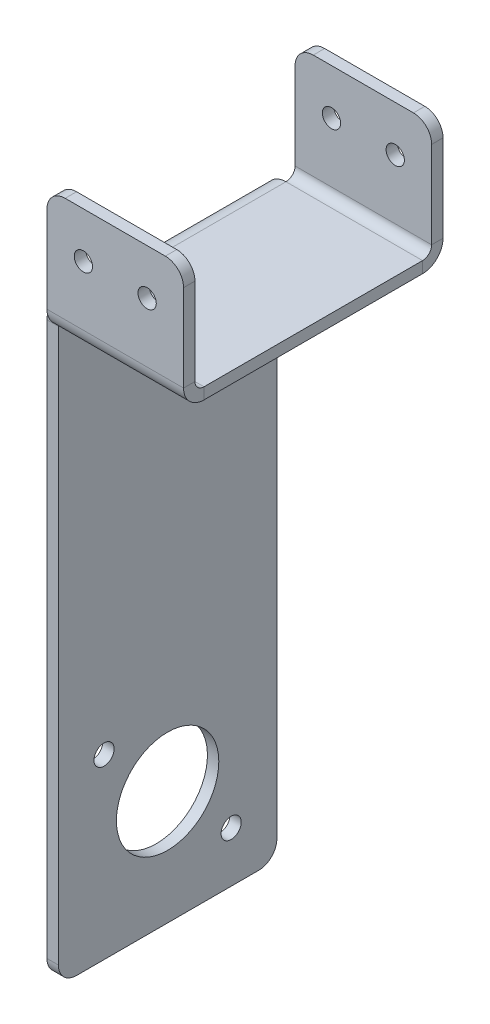
ISO-10303-21;
HEADER;
FILE_DESCRIPTION(('STEP AP214'),'2;1');
FILE_NAME('part.step','',(''),(''),'','','');
FILE_SCHEMA(('AUTOMOTIVE_DESIGN { 1 0 10303 214 1 1 1 1 }'));
ENDSEC;
DATA;
#1=APPLICATION_CONTEXT('core data for automotive mechanical design processes');
#2=APPLICATION_PROTOCOL_DEFINITION('international standard','automotive_design',2000,#1);
#3=PRODUCT_CONTEXT('',#1,'mechanical');
#4=PRODUCT('Part','Part','',(#3));
#5=PRODUCT_RELATED_PRODUCT_CATEGORY('part','',(#4));
#6=PRODUCT_DEFINITION_FORMATION('','',#4);
#7=PRODUCT_DEFINITION_CONTEXT('part definition',#1,'design');
#8=PRODUCT_DEFINITION('design','',#6,#7);
#9=PRODUCT_DEFINITION_SHAPE('','',#8);
#10=(LENGTH_UNIT() NAMED_UNIT(*) SI_UNIT(.MILLI.,.METRE.));
#11=(NAMED_UNIT(*) PLANE_ANGLE_UNIT() SI_UNIT($,.RADIAN.));
#12=(NAMED_UNIT(*) SI_UNIT($,.STERADIAN.) SOLID_ANGLE_UNIT());
#13=UNCERTAINTY_MEASURE_WITH_UNIT(LENGTH_MEASURE(1.E-05),#10,'distance_accuracy_value','');
#14=(GEOMETRIC_REPRESENTATION_CONTEXT(3) GLOBAL_UNCERTAINTY_ASSIGNED_CONTEXT((#13)) GLOBAL_UNIT_ASSIGNED_CONTEXT((#10,
#11,#12)) REPRESENTATION_CONTEXT('',''));
#15=CARTESIAN_POINT('',(0.,0.,0.));
#16=DIRECTION('',(0.,0.,1.));
#17=DIRECTION('',(1.,0.,0.));
#18=AXIS2_PLACEMENT_3D('',#15,#16,#17);
#19=CARTESIAN_POINT('',(19.05,-3.175,30.48));
#20=DIRECTION('',(1.,0.,0.));
#21=DIRECTION('',(0.,0.,-1.));
#22=AXIS2_PLACEMENT_3D('',#19,#20,#21);
#23=PLANE('',#22);
#24=DIRECTION('',(0.,0.,-1.));
#25=VECTOR('',#24,1.);
#26=CARTESIAN_POINT('',(19.05,0.,30.48));
#27=LINE('',#26,#25);
#28=CARTESIAN_POINT('',(19.05,0.,30.48));
#29=VERTEX_POINT('',#28);
#30=CARTESIAN_POINT('',(19.05,0.,-30.48));
#31=VERTEX_POINT('',#30);
#32=EDGE_CURVE('E370',#29,#31,#27,.T.);
#33=ORIENTED_EDGE('',*,*,#32,.F.);
#34=DIRECTION('',(0.,1.,0.));
#35=VECTOR('',#34,1.);
#36=CARTESIAN_POINT('',(19.05,-3.175,30.48));
#37=LINE('',#36,#35);
#38=CARTESIAN_POINT('',(19.05,-3.175,30.48));
#39=VERTEX_POINT('',#38);
#40=EDGE_CURVE('E399',#39,#29,#37,.T.);
#41=ORIENTED_EDGE('',*,*,#40,.F.);
#42=DIRECTION('',(0.,0.,-1.));
#43=VECTOR('',#42,1.);
#44=CARTESIAN_POINT('',(19.05,-3.175,30.48));
#45=LINE('',#44,#43);
#46=CARTESIAN_POINT('',(19.05,-3.175,-30.48));
#47=VERTEX_POINT('',#46);
#48=EDGE_CURVE('E379',#39,#47,#45,.T.);
#49=ORIENTED_EDGE('',*,*,#48,.T.);
#50=DIRECTION('',(0.,1.,0.));
#51=VECTOR('',#50,1.);
#52=CARTESIAN_POINT('',(19.05,-3.175,-30.48));
#53=LINE('',#52,#51);
#54=EDGE_CURVE('E391',#47,#31,#53,.T.);
#55=ORIENTED_EDGE('',*,*,#54,.T.);
#56=EDGE_LOOP('',(#33,#41,#49,#55));
#57=FACE_BOUND('',#56,.T.);
#58=ADVANCED_FACE('F99',(#57),#23,.T.);
#59=CARTESIAN_POINT('',(0.,-3.175,0.));
#60=DIRECTION('',(0.,-1.,0.));
#61=DIRECTION('',(0.,0.,-1.));
#62=AXIS2_PLACEMENT_3D('',#59,#60,#61);
#63=PLANE('',#62);
#64=ORIENTED_EDGE('',*,*,#48,.F.);
#65=DIRECTION('',(1.,0.,0.));
#66=VECTOR('',#65,1.);
#67=CARTESIAN_POINT('',(-19.05,-3.175,30.48));
#68=LINE('',#67,#66);
#69=CARTESIAN_POINT('',(-19.05,-3.175,30.48));
#70=VERTEX_POINT('',#69);
#71=EDGE_CURVE('E388',#70,#39,#68,.T.);
#72=ORIENTED_EDGE('',*,*,#71,.F.);
#73=DIRECTION('',(0.,0.,1.));
#74=VECTOR('',#73,1.);
#75=CARTESIAN_POINT('',(-19.05,-3.175,30.48));
#76=LINE('',#75,#74);
#77=CARTESIAN_POINT('',(-19.05,-3.17500000000003,-30.48));
#78=VERTEX_POINT('',#77);
#79=EDGE_CURVE('E386',#78,#70,#76,.T.);
#80=ORIENTED_EDGE('',*,*,#79,.F.);
#81=DIRECTION('',(-1.,0.,0.));
#82=VECTOR('',#81,1.);
#83=CARTESIAN_POINT('',(-19.05,-3.175,-30.48));
#84=LINE('',#83,#82);
#85=EDGE_CURVE('E382',#47,#78,#84,.T.);
#86=ORIENTED_EDGE('',*,*,#85,.F.);
#87=EDGE_LOOP('',(#64,#72,#80,#86));
#88=FACE_BOUND('',#87,.T.);
#89=ADVANCED_FACE('F499',(#88),#63,.T.);
#90=CARTESIAN_POINT('',(0.,0.,0.));
#91=DIRECTION('',(0.,-1.,0.));
#92=DIRECTION('',(0.,0.,-1.));
#93=AXIS2_PLACEMENT_3D('',#90,#91,#92);
#94=PLANE('',#93);
#95=ORIENTED_EDGE('',*,*,#32,.T.);
#96=DIRECTION('',(-1.,0.,0.));
#97=VECTOR('',#96,1.);
#98=CARTESIAN_POINT('',(-19.05,0.,-30.48));
#99=LINE('',#98,#97);
#100=CARTESIAN_POINT('',(-19.05,0.,-30.48));
#101=VERTEX_POINT('',#100);
#102=EDGE_CURVE('E394',#31,#101,#99,.T.);
#103=ORIENTED_EDGE('',*,*,#102,.T.);
#104=DIRECTION('',(0.,0.,1.));
#105=VECTOR('',#104,1.);
#106=CARTESIAN_POINT('',(-19.05,0.,30.48));
#107=LINE('',#106,#105);
#108=CARTESIAN_POINT('',(-19.05,0.,30.48));
#109=VERTEX_POINT('',#108);
#110=EDGE_CURVE('E258',#101,#109,#107,.T.);
#111=ORIENTED_EDGE('',*,*,#110,.T.);
#112=DIRECTION('',(1.,0.,0.));
#113=VECTOR('',#112,1.);
#114=CARTESIAN_POINT('',(-19.05,0.,30.48));
#115=LINE('',#114,#113);
#116=EDGE_CURVE('E383',#109,#29,#115,.T.);
#117=ORIENTED_EDGE('',*,*,#116,.T.);
#118=EDGE_LOOP('',(#95,#103,#111,#117));
#119=FACE_BOUND('',#118,.T.);
#120=ADVANCED_FACE('F560',(#119),#94,.F.);
#121=CARTESIAN_POINT('',(-19.05,2.53999999999999,30.48));
#122=DIRECTION('',(-1.,0.,0.));
#123=DIRECTION('',(0.,0.,1.));
#124=AXIS2_PLACEMENT_3D('',#121,#122,#123);
#125=PLANE('',#124);
#126=DIRECTION('',(0.,0.,-1.));
#127=VECTOR('',#126,1.);
#128=CARTESIAN_POINT('',(-19.05,2.53999999999999,36.195));
#129=LINE('',#128,#127);
#130=CARTESIAN_POINT('',(-19.05,2.53999999999999,33.02));
#131=VERTEX_POINT('',#130);
#132=CARTESIAN_POINT('',(-19.05,2.53999999999999,36.195));
#133=VERTEX_POINT('',#132);
#134=EDGE_CURVE('E331',#131,#133,#129,.F.);
#135=ORIENTED_EDGE('',*,*,#134,.F.);
#136=CARTESIAN_POINT('',(-19.05,2.53999999999999,30.48));
#137=DIRECTION('',(1.,0.,0.));
#138=DIRECTION('',(0.,0.,-1.));
#139=AXIS2_PLACEMENT_3D('',#136,#137,#138);
#140=CIRCLE('',#139,2.53999999999999);
#141=EDGE_CURVE('E374',#109,#131,#140,.F.);
#142=ORIENTED_EDGE('',*,*,#141,.F.);
#143=DIRECTION('',(0.,1.,0.));
#144=VECTOR('',#143,1.);
#145=CARTESIAN_POINT('',(-19.05,-3.175,30.48));
#146=LINE('',#145,#144);
#147=EDGE_CURVE('E403',#70,#109,#146,.T.);
#148=ORIENTED_EDGE('',*,*,#147,.F.);
#149=CARTESIAN_POINT('',(-19.05,2.53999999999999,30.48));
#150=DIRECTION('',(1.,0.,0.));
#151=DIRECTION('',(0.,0.,-1.));
#152=AXIS2_PLACEMENT_3D('',#149,#150,#151);
#153=CIRCLE('',#152,5.71499999999999);
#154=EDGE_CURVE('E367',#70,#133,#153,.F.);
#155=ORIENTED_EDGE('',*,*,#154,.T.);
#156=EDGE_LOOP('',(#135,#142,#148,#155));
#157=FACE_BOUND('',#156,.T.);
#158=ADVANCED_FACE('F506',(#157),#125,.T.);
#159=CARTESIAN_POINT('',(19.05,2.53999999999999,30.48));
#160=DIRECTION('',(-1.,0.,0.));
#161=DIRECTION('',(0.,0.,1.));
#162=AXIS2_PLACEMENT_3D('',#159,#160,#161);
#163=PLANE('',#162);
#164=CARTESIAN_POINT('',(19.05,2.53999999999999,30.48));
#165=DIRECTION('',(1.,0.,0.));
#166=DIRECTION('',(0.,0.,-1.));
#167=AXIS2_PLACEMENT_3D('',#164,#165,#166);
#168=CIRCLE('',#167,2.53999999999999);
#169=CARTESIAN_POINT('',(19.05,2.53999999999999,33.02));
#170=VERTEX_POINT('',#169);
#171=EDGE_CURVE('E343',#170,#29,#168,.T.);
#172=ORIENTED_EDGE('',*,*,#171,.F.);
#173=DIRECTION('',(0.,0.,-1.));
#174=VECTOR('',#173,1.);
#175=CARTESIAN_POINT('',(19.05,2.53999999999999,33.02));
#176=LINE('',#175,#174);
#177=CARTESIAN_POINT('',(19.05,2.53999999999999,36.195));
#178=VERTEX_POINT('',#177);
#179=EDGE_CURVE('E360',#170,#178,#176,.F.);
#180=ORIENTED_EDGE('',*,*,#179,.T.);
#181=CARTESIAN_POINT('',(19.05,2.53999999999999,30.48));
#182=DIRECTION('',(1.,0.,0.));
#183=DIRECTION('',(0.,0.,-1.));
#184=AXIS2_PLACEMENT_3D('',#181,#182,#183);
#185=CIRCLE('',#184,5.71499999999999);
#186=EDGE_CURVE('E371',#178,#39,#185,.T.);
#187=ORIENTED_EDGE('',*,*,#186,.T.);
#188=ORIENTED_EDGE('',*,*,#40,.T.);
#189=EDGE_LOOP('',(#172,#180,#187,#188));
#190=FACE_BOUND('',#189,.T.);
#191=ADVANCED_FACE('F912',(#190),#163,.F.);
#192=CARTESIAN_POINT('',(19.05,2.53999999999999,30.48));
#193=DIRECTION('',(1.,0.,0.));
#194=DIRECTION('',(0.,0.,1.));
#195=AXIS2_PLACEMENT_3D('',#192,#193,#194);
#196=CYLINDRICAL_SURFACE('',#195,5.71499999999999);
#197=ORIENTED_EDGE('',*,*,#71,.T.);
#198=ORIENTED_EDGE('',*,*,#186,.F.);
#199=DIRECTION('',(1.,0.,0.));
#200=VECTOR('',#199,1.);
#201=CARTESIAN_POINT('',(-19.05,2.53999999999999,36.195));
#202=LINE('',#201,#200);
#203=EDGE_CURVE('E357',#178,#133,#202,.F.);
#204=ORIENTED_EDGE('',*,*,#203,.T.);
#205=ORIENTED_EDGE('',*,*,#154,.F.);
#206=EDGE_LOOP('',(#197,#198,#204,#205));
#207=FACE_BOUND('',#206,.T.);
#208=ADVANCED_FACE('F507',(#207),#196,.T.);
#209=CARTESIAN_POINT('',(19.05,2.53999999999999,30.48));
#210=DIRECTION('',(1.,0.,0.));
#211=DIRECTION('',(0.,0.,1.));
#212=AXIS2_PLACEMENT_3D('',#209,#210,#211);
#213=CYLINDRICAL_SURFACE('',#212,2.53999999999999);
#214=ORIENTED_EDGE('',*,*,#116,.F.);
#215=ORIENTED_EDGE('',*,*,#141,.T.);
#216=DIRECTION('',(1.,0.,0.));
#217=VECTOR('',#216,1.);
#218=CARTESIAN_POINT('',(-19.05,2.53999999999999,33.02));
#219=LINE('',#218,#217);
#220=EDGE_CURVE('E363',#131,#170,#219,.T.);
#221=ORIENTED_EDGE('',*,*,#220,.T.);
#222=ORIENTED_EDGE('',*,*,#171,.T.);
#223=EDGE_LOOP('',(#214,#215,#221,#222));
#224=FACE_BOUND('',#223,.T.);
#225=ADVANCED_FACE('F537',(#224),#213,.F.);
#226=CARTESIAN_POINT('',(-19.05,0.,36.195));
#227=DIRECTION('',(1.,0.,0.));
#228=DIRECTION('',(0.,1.,0.));
#229=AXIS2_PLACEMENT_3D('',#226,#227,#228);
#230=PLANE('',#229);
#231=DIRECTION('',(0.,-1.,0.));
#232=VECTOR('',#231,1.);
#233=CARTESIAN_POINT('',(-19.05,0.,36.195));
#234=LINE('',#233,#232);
#235=CARTESIAN_POINT('',(-19.05,26.797,36.195));
#236=VERTEX_POINT('',#235);
#237=EDGE_CURVE('E347',#236,#133,#234,.T.);
#238=ORIENTED_EDGE('',*,*,#237,.F.);
#239=DIRECTION('',(0.,0.,-1.));
#240=VECTOR('',#239,1.);
#241=CARTESIAN_POINT('',(-19.05,26.797,36.195));
#242=LINE('',#241,#240);
#243=CARTESIAN_POINT('',(-19.05,26.797,33.02));
#244=VERTEX_POINT('',#243);
#245=EDGE_CURVE('E442',#236,#244,#242,.T.);
#246=ORIENTED_EDGE('',*,*,#245,.T.);
#247=DIRECTION('',(0.,1.,0.));
#248=VECTOR('',#247,1.);
#249=CARTESIAN_POINT('',(-19.05,0.,33.02));
#250=LINE('',#249,#248);
#251=EDGE_CURVE('E355',#244,#131,#250,.F.);
#252=ORIENTED_EDGE('',*,*,#251,.T.);
#253=ORIENTED_EDGE('',*,*,#134,.T.);
#254=EDGE_LOOP('',(#238,#246,#252,#253));
#255=FACE_BOUND('',#254,.T.);
#256=ADVANCED_FACE('F532',(#255),#230,.F.);
#257=CARTESIAN_POINT('',(19.05,31.877,36.195));
#258=DIRECTION('',(-1.,0.,0.));
#259=DIRECTION('',(0.,-1.,0.));
#260=AXIS2_PLACEMENT_3D('',#257,#258,#259);
#261=PLANE('',#260);
#262=DIRECTION('',(0.,-1.,0.));
#263=VECTOR('',#262,1.);
#264=CARTESIAN_POINT('',(19.05,31.877,33.02));
#265=LINE('',#264,#263);
#266=CARTESIAN_POINT('',(19.05,26.797,33.02));
#267=VERTEX_POINT('',#266);
#268=EDGE_CURVE('E352',#170,#267,#265,.F.);
#269=ORIENTED_EDGE('',*,*,#268,.T.);
#270=DIRECTION('',(0.,0.,-1.));
#271=VECTOR('',#270,1.);
#272=CARTESIAN_POINT('',(19.05,26.797,36.195));
#273=LINE('',#272,#271);
#274=CARTESIAN_POINT('',(19.05,26.797,36.195));
#275=VERTEX_POINT('',#274);
#276=EDGE_CURVE('E436',#267,#275,#273,.F.);
#277=ORIENTED_EDGE('',*,*,#276,.T.);
#278=DIRECTION('',(0.,1.,0.));
#279=VECTOR('',#278,1.);
#280=CARTESIAN_POINT('',(19.05,0.,36.195));
#281=LINE('',#280,#279);
#282=EDGE_CURVE('E344',#178,#275,#281,.T.);
#283=ORIENTED_EDGE('',*,*,#282,.F.);
#284=ORIENTED_EDGE('',*,*,#179,.F.);
#285=EDGE_LOOP('',(#269,#277,#283,#284));
#286=FACE_BOUND('',#285,.T.);
#287=ADVANCED_FACE('F516',(#286),#261,.F.);
#288=CARTESIAN_POINT('',(0.,0.,36.195));
#289=DIRECTION('',(0.,0.,-1.));
#290=DIRECTION('',(-1.,0.,0.));
#291=AXIS2_PLACEMENT_3D('',#288,#289,#290);
#292=PLANE('',#291);
#293=CARTESIAN_POINT('',(8.89,19.177,36.195));
#294=DIRECTION('',(0.,0.,1.));
#295=DIRECTION('',(1.,0.,0.));
#296=AXIS2_PLACEMENT_3D('',#293,#294,#295);
#297=CIRCLE('',#296,2.5527);
#298=CARTESIAN_POINT('',(11.4427,19.177,36.195));
#299=VERTEX_POINT('',#298);
#300=EDGE_CURVE('E1048',#299,#299,#297,.T.);
#301=ORIENTED_EDGE('',*,*,#300,.F.);
#302=EDGE_LOOP('',(#301));
#303=FACE_BOUND('',#302,.T.);
#304=CARTESIAN_POINT('',(-8.88999999999999,19.177,36.195));
#305=DIRECTION('',(0.,0.,1.));
#306=DIRECTION('',(1.,0.,0.));
#307=AXIS2_PLACEMENT_3D('',#304,#305,#306);
#308=CIRCLE('',#307,2.5527);
#309=CARTESIAN_POINT('',(-6.33729999999999,19.177,36.195));
#310=VERTEX_POINT('',#309);
#311=EDGE_CURVE('E1042',#310,#310,#308,.T.);
#312=ORIENTED_EDGE('',*,*,#311,.F.);
#313=EDGE_LOOP('',(#312));
#314=FACE_BOUND('',#313,.T.);
#315=ORIENTED_EDGE('',*,*,#282,.T.);
#316=CARTESIAN_POINT('',(13.97,26.797,36.195));
#317=DIRECTION('',(0.,0.,-1.));
#318=DIRECTION('',(-1.,0.,0.));
#319=AXIS2_PLACEMENT_3D('',#316,#317,#318);
#320=CIRCLE('',#319,5.08);
#321=CARTESIAN_POINT('',(13.97,31.877,36.195));
#322=VERTEX_POINT('',#321);
#323=EDGE_CURVE('E440',#275,#322,#320,.F.);
#324=ORIENTED_EDGE('',*,*,#323,.T.);
#325=DIRECTION('',(-1.,0.,0.));
#326=VECTOR('',#325,1.);
#327=CARTESIAN_POINT('',(0.,31.877,36.195));
#328=LINE('',#327,#326);
#329=CARTESIAN_POINT('',(-13.97,31.877,36.195));
#330=VERTEX_POINT('',#329);
#331=EDGE_CURVE('E340',#322,#330,#328,.T.);
#332=ORIENTED_EDGE('',*,*,#331,.T.);
#333=CARTESIAN_POINT('',(-13.97,26.797,36.195));
#334=DIRECTION('',(0.,0.,-1.));
#335=DIRECTION('',(-1.,0.,0.));
#336=AXIS2_PLACEMENT_3D('',#333,#334,#335);
#337=CIRCLE('',#336,5.08);
#338=EDGE_CURVE('E438',#330,#236,#337,.F.);
#339=ORIENTED_EDGE('',*,*,#338,.T.);
#340=ORIENTED_EDGE('',*,*,#237,.T.);
#341=ORIENTED_EDGE('',*,*,#203,.F.);
#342=EDGE_LOOP('',(#315,#324,#332,#339,#340,#341));
#343=FACE_BOUND('',#342,.T.);
#344=ADVANCED_FACE('F511',(#303,#314,#343),#292,.F.);
#345=CARTESIAN_POINT('',(0.,0.,33.02));
#346=DIRECTION('',(0.,0.,-1.));
#347=DIRECTION('',(-1.,0.,0.));
#348=AXIS2_PLACEMENT_3D('',#345,#346,#347);
#349=PLANE('',#348);
#350=CARTESIAN_POINT('',(8.89,19.177,33.02));
#351=DIRECTION('',(0.,0.,-1.));
#352=DIRECTION('',(-1.,0.,0.));
#353=AXIS2_PLACEMENT_3D('',#350,#351,#352);
#354=CIRCLE('',#353,2.5527);
#355=CARTESIAN_POINT('',(6.33729999999999,19.177,33.02));
#356=VERTEX_POINT('',#355);
#357=EDGE_CURVE('E427',#356,#356,#354,.T.);
#358=ORIENTED_EDGE('',*,*,#357,.F.);
#359=EDGE_LOOP('',(#358));
#360=FACE_BOUND('',#359,.T.);
#361=CARTESIAN_POINT('',(-8.88999999999999,19.177,33.02));
#362=DIRECTION('',(0.,0.,-1.));
#363=DIRECTION('',(-1.,0.,0.));
#364=AXIS2_PLACEMENT_3D('',#361,#362,#363);
#365=CIRCLE('',#364,2.5527);
#366=CARTESIAN_POINT('',(-11.4427,19.177,33.02));
#367=VERTEX_POINT('',#366);
#368=EDGE_CURVE('E422',#367,#367,#365,.T.);
#369=ORIENTED_EDGE('',*,*,#368,.F.);
#370=EDGE_LOOP('',(#369));
#371=FACE_BOUND('',#370,.T.);
#372=DIRECTION('',(1.,0.,0.));
#373=VECTOR('',#372,1.);
#374=CARTESIAN_POINT('',(-19.05,31.877,33.02));
#375=LINE('',#374,#373);
#376=CARTESIAN_POINT('',(13.97,31.877,33.02));
#377=VERTEX_POINT('',#376);
#378=CARTESIAN_POINT('',(-13.97,31.877,33.02));
#379=VERTEX_POINT('',#378);
#380=EDGE_CURVE('E349',#377,#379,#375,.F.);
#381=ORIENTED_EDGE('',*,*,#380,.F.);
#382=CARTESIAN_POINT('',(13.97,26.797,33.02));
#383=DIRECTION('',(0.,0.,-1.));
#384=DIRECTION('',(-1.,0.,0.));
#385=AXIS2_PLACEMENT_3D('',#382,#383,#384);
#386=CIRCLE('',#385,5.08);
#387=EDGE_CURVE('E434',#377,#267,#386,.T.);
#388=ORIENTED_EDGE('',*,*,#387,.T.);
#389=ORIENTED_EDGE('',*,*,#268,.F.);
#390=ORIENTED_EDGE('',*,*,#220,.F.);
#391=ORIENTED_EDGE('',*,*,#251,.F.);
#392=CARTESIAN_POINT('',(-13.97,26.797,33.02));
#393=DIRECTION('',(0.,0.,-1.));
#394=DIRECTION('',(-1.,0.,0.));
#395=AXIS2_PLACEMENT_3D('',#392,#393,#394);
#396=CIRCLE('',#395,5.08);
#397=EDGE_CURVE('E432',#244,#379,#396,.T.);
#398=ORIENTED_EDGE('',*,*,#397,.T.);
#399=EDGE_LOOP('',(#381,#388,#389,#390,#391,#398));
#400=FACE_BOUND('',#399,.T.);
#401=ADVANCED_FACE('F540',(#360,#371,#400),#349,.T.);
#402=CARTESIAN_POINT('',(-19.05,31.877,36.195));
#403=DIRECTION('',(0.,-1.,0.));
#404=DIRECTION('',(0.,0.,-1.));
#405=AXIS2_PLACEMENT_3D('',#402,#403,#404);
#406=PLANE('',#405);
#407=ORIENTED_EDGE('',*,*,#331,.F.);
#408=DIRECTION('',(0.,0.,-1.));
#409=VECTOR('',#408,1.);
#410=CARTESIAN_POINT('',(13.97,31.877,36.195));
#411=LINE('',#410,#409);
#412=EDGE_CURVE('E429',#322,#377,#411,.T.);
#413=ORIENTED_EDGE('',*,*,#412,.T.);
#414=ORIENTED_EDGE('',*,*,#380,.T.);
#415=DIRECTION('',(0.,0.,-1.));
#416=VECTOR('',#415,1.);
#417=CARTESIAN_POINT('',(-13.97,31.877,36.195));
#418=LINE('',#417,#416);
#419=EDGE_CURVE('E402',#379,#330,#418,.F.);
#420=ORIENTED_EDGE('',*,*,#419,.T.);
#421=EDGE_LOOP('',(#407,#413,#414,#420));
#422=FACE_BOUND('',#421,.T.);
#423=ADVANCED_FACE('F525',(#422),#406,.F.);
#424=CARTESIAN_POINT('',(19.05,2.53999999999997,-30.48));
#425=DIRECTION('',(1.,0.,0.));
#426=DIRECTION('',(0.,0.,-1.));
#427=AXIS2_PLACEMENT_3D('',#424,#425,#426);
#428=PLANE('',#427);
#429=DIRECTION('',(0.,0.,1.));
#430=VECTOR('',#429,1.);
#431=CARTESIAN_POINT('',(19.05,2.54000000000001,-36.195));
#432=LINE('',#431,#430);
#433=CARTESIAN_POINT('',(19.05,2.53999999999996,-33.02));
#434=VERTEX_POINT('',#433);
#435=CARTESIAN_POINT('',(19.05,2.53999999999995,-36.195));
#436=VERTEX_POINT('',#435);
#437=EDGE_CURVE('E296',#434,#436,#432,.F.);
#438=ORIENTED_EDGE('',*,*,#437,.F.);
#439=CARTESIAN_POINT('',(19.05,2.53999999999997,-30.48));
#440=DIRECTION('',(-1.,0.,0.));
#441=DIRECTION('',(0.,0.,1.));
#442=AXIS2_PLACEMENT_3D('',#439,#440,#441);
#443=CIRCLE('',#442,2.54);
#444=EDGE_CURVE('E335',#31,#434,#443,.F.);
#445=ORIENTED_EDGE('',*,*,#444,.F.);
#446=ORIENTED_EDGE('',*,*,#54,.F.);
#447=CARTESIAN_POINT('',(19.05,2.53999999999997,-30.48));
#448=DIRECTION('',(-1.,0.,0.));
#449=DIRECTION('',(0.,0.,1.));
#450=AXIS2_PLACEMENT_3D('',#447,#448,#449);
#451=CIRCLE('',#450,5.715);
#452=EDGE_CURVE('E328',#47,#436,#451,.F.);
#453=ORIENTED_EDGE('',*,*,#452,.T.);
#454=EDGE_LOOP('',(#438,#445,#446,#453));
#455=FACE_BOUND('',#454,.T.);
#456=ADVANCED_FACE('F548',(#455),#428,.T.);
#457=CARTESIAN_POINT('',(-19.05,2.53999999999997,-30.48));
#458=DIRECTION('',(1.,0.,0.));
#459=DIRECTION('',(0.,0.,-1.));
#460=AXIS2_PLACEMENT_3D('',#457,#458,#459);
#461=PLANE('',#460);
#462=CARTESIAN_POINT('',(-19.05,2.53999999999997,-30.48));
#463=DIRECTION('',(-1.,0.,0.));
#464=DIRECTION('',(0.,0.,1.));
#465=AXIS2_PLACEMENT_3D('',#462,#463,#464);
#466=CIRCLE('',#465,2.54);
#467=CARTESIAN_POINT('',(-19.05,2.53999999999996,-33.02));
#468=VERTEX_POINT('',#467);
#469=EDGE_CURVE('E304',#468,#101,#466,.T.);
#470=ORIENTED_EDGE('',*,*,#469,.F.);
#471=DIRECTION('',(0.,0.,1.));
#472=VECTOR('',#471,1.);
#473=CARTESIAN_POINT('',(-19.05,2.53999999999999,-33.02));
#474=LINE('',#473,#472);
#475=CARTESIAN_POINT('',(-19.05,2.54000000000001,-36.195));
#476=VERTEX_POINT('',#475);
#477=EDGE_CURVE('E321',#468,#476,#474,.F.);
#478=ORIENTED_EDGE('',*,*,#477,.T.);
#479=CARTESIAN_POINT('',(-19.05,2.53999999999997,-30.48));
#480=DIRECTION('',(-1.,0.,0.));
#481=DIRECTION('',(0.,0.,1.));
#482=AXIS2_PLACEMENT_3D('',#479,#480,#481);
#483=CIRCLE('',#482,5.715);
#484=EDGE_CURVE('E332',#476,#78,#483,.T.);
#485=ORIENTED_EDGE('',*,*,#484,.T.);
#486=DIRECTION('',(0.,1.,0.));
#487=VECTOR('',#486,1.);
#488=CARTESIAN_POINT('',(-19.05,-3.175,-30.48));
#489=LINE('',#488,#487);
#490=EDGE_CURVE('E406',#78,#101,#489,.T.);
#491=ORIENTED_EDGE('',*,*,#490,.T.);
#492=EDGE_LOOP('',(#470,#478,#485,#491));
#493=FACE_BOUND('',#492,.T.);
#494=ADVANCED_FACE('F884',(#493),#461,.F.);
#495=CARTESIAN_POINT('',(-19.05,2.53999999999997,-30.48));
#496=DIRECTION('',(-1.,0.,0.));
#497=DIRECTION('',(0.,0.,-1.));
#498=AXIS2_PLACEMENT_3D('',#495,#496,#497);
#499=CYLINDRICAL_SURFACE('',#498,5.715);
#500=ORIENTED_EDGE('',*,*,#85,.T.);
#501=ORIENTED_EDGE('',*,*,#484,.F.);
#502=DIRECTION('',(-1.,0.,0.));
#503=VECTOR('',#502,1.);
#504=CARTESIAN_POINT('',(19.05,2.54000000000001,-36.195));
#505=LINE('',#504,#503);
#506=EDGE_CURVE('E318',#476,#436,#505,.F.);
#507=ORIENTED_EDGE('',*,*,#506,.T.);
#508=ORIENTED_EDGE('',*,*,#452,.F.);
#509=EDGE_LOOP('',(#500,#501,#507,#508));
#510=FACE_BOUND('',#509,.T.);
#511=ADVANCED_FACE('F873',(#510),#499,.T.);
#512=CARTESIAN_POINT('',(-19.05,2.53999999999997,-30.48));
#513=DIRECTION('',(-1.,0.,0.));
#514=DIRECTION('',(0.,0.,-1.));
#515=AXIS2_PLACEMENT_3D('',#512,#513,#514);
#516=CYLINDRICAL_SURFACE('',#515,2.54);
#517=ORIENTED_EDGE('',*,*,#102,.F.);
#518=ORIENTED_EDGE('',*,*,#444,.T.);
#519=DIRECTION('',(-1.,0.,0.));
#520=VECTOR('',#519,1.);
#521=CARTESIAN_POINT('',(19.05,2.53999999999999,-33.02));
#522=LINE('',#521,#520);
#523=EDGE_CURVE('E324',#434,#468,#522,.T.);
#524=ORIENTED_EDGE('',*,*,#523,.T.);
#525=ORIENTED_EDGE('',*,*,#469,.T.);
#526=EDGE_LOOP('',(#517,#518,#524,#525));
#527=FACE_BOUND('',#526,.T.);
#528=ADVANCED_FACE('F720',(#527),#516,.F.);
#529=CARTESIAN_POINT('',(19.05,0.,-36.195));
#530=DIRECTION('',(-1.,0.,0.));
#531=DIRECTION('',(0.,-1.,0.));
#532=AXIS2_PLACEMENT_3D('',#529,#530,#531);
#533=PLANE('',#532);
#534=DIRECTION('',(0.,-1.,0.));
#535=VECTOR('',#534,1.);
#536=CARTESIAN_POINT('',(19.05,-1.25535735171847E-13,-36.195));
#537=LINE('',#536,#535);
#538=CARTESIAN_POINT('',(19.05,26.797,-36.1950000000001));
#539=VERTEX_POINT('',#538);
#540=EDGE_CURVE('E308',#539,#436,#537,.T.);
#541=ORIENTED_EDGE('',*,*,#540,.F.);
#542=DIRECTION('',(0.,0.,1.));
#543=VECTOR('',#542,1.);
#544=CARTESIAN_POINT('',(19.05,26.797,-36.1950000000001));
#545=LINE('',#544,#543);
#546=CARTESIAN_POINT('',(19.05,26.797,-33.0200000000001));
#547=VERTEX_POINT('',#546);
#548=EDGE_CURVE('E460',#539,#547,#545,.T.);
#549=ORIENTED_EDGE('',*,*,#548,.T.);
#550=DIRECTION('',(0.,1.,0.));
#551=VECTOR('',#550,1.);
#552=CARTESIAN_POINT('',(19.05,0.,-33.02));
#553=LINE('',#552,#551);
#554=EDGE_CURVE('E316',#547,#434,#553,.F.);
#555=ORIENTED_EDGE('',*,*,#554,.T.);
#556=ORIENTED_EDGE('',*,*,#437,.T.);
#557=EDGE_LOOP('',(#541,#549,#555,#556));
#558=FACE_BOUND('',#557,.T.);
#559=ADVANCED_FACE('F709',(#558),#533,.F.);
#560=CARTESIAN_POINT('',(-19.05,31.877,-36.1950000000001));
#561=DIRECTION('',(1.,0.,0.));
#562=DIRECTION('',(0.,1.,0.));
#563=AXIS2_PLACEMENT_3D('',#560,#561,#562);
#564=PLANE('',#563);
#565=DIRECTION('',(0.,-1.,0.));
#566=VECTOR('',#565,1.);
#567=CARTESIAN_POINT('',(-19.05,31.877,-33.0200000000001));
#568=LINE('',#567,#566);
#569=CARTESIAN_POINT('',(-19.05,26.797,-33.0200000000001));
#570=VERTEX_POINT('',#569);
#571=EDGE_CURVE('E313',#468,#570,#568,.F.);
#572=ORIENTED_EDGE('',*,*,#571,.T.);
#573=DIRECTION('',(0.,0.,1.));
#574=VECTOR('',#573,1.);
#575=CARTESIAN_POINT('',(-19.05,26.797,-36.1950000000001));
#576=LINE('',#575,#574);
#577=CARTESIAN_POINT('',(-19.05,26.797,-36.1950000000001));
#578=VERTEX_POINT('',#577);
#579=EDGE_CURVE('E454',#570,#578,#576,.F.);
#580=ORIENTED_EDGE('',*,*,#579,.T.);
#581=DIRECTION('',(0.,1.,0.));
#582=VECTOR('',#581,1.);
#583=CARTESIAN_POINT('',(-19.05,-1.04801988447024E-13,-36.195));
#584=LINE('',#583,#582);
#585=EDGE_CURVE('E305',#476,#578,#584,.T.);
#586=ORIENTED_EDGE('',*,*,#585,.F.);
#587=ORIENTED_EDGE('',*,*,#477,.F.);
#588=EDGE_LOOP('',(#572,#580,#586,#587));
#589=FACE_BOUND('',#588,.T.);
#590=ADVANCED_FACE('F698',(#589),#564,.F.);
#591=CARTESIAN_POINT('',(0.,-1.17242236481918E-13,-36.195));
#592=DIRECTION('',(0.,0.,1.));
#593=DIRECTION('',(0.,-1.,0.));
#594=AXIS2_PLACEMENT_3D('',#591,#592,#593);
#595=PLANE('',#594);
#596=CARTESIAN_POINT('',(8.89,19.177,-36.1950000000001));
#597=DIRECTION('',(0.,0.,1.));
#598=DIRECTION('',(1.,0.,0.));
#599=AXIS2_PLACEMENT_3D('',#596,#597,#598);
#600=CIRCLE('',#599,2.5527);
#601=CARTESIAN_POINT('',(11.4427,19.177,-36.1950000000001));
#602=VERTEX_POINT('',#601);
#603=EDGE_CURVE('E423',#602,#602,#600,.T.);
#604=ORIENTED_EDGE('',*,*,#603,.T.);
#605=EDGE_LOOP('',(#604));
#606=FACE_BOUND('',#605,.T.);
#607=CARTESIAN_POINT('',(-8.88999999999999,19.177,-36.1950000000001));
#608=DIRECTION('',(0.,0.,1.));
#609=DIRECTION('',(1.,0.,0.));
#610=AXIS2_PLACEMENT_3D('',#607,#608,#609);
#611=CIRCLE('',#610,2.5527);
#612=CARTESIAN_POINT('',(-6.33729999999999,19.177,-36.1950000000001));
#613=VERTEX_POINT('',#612);
#614=EDGE_CURVE('E1045',#613,#613,#611,.T.);
#615=ORIENTED_EDGE('',*,*,#614,.T.);
#616=EDGE_LOOP('',(#615));
#617=FACE_BOUND('',#616,.T.);
#618=ORIENTED_EDGE('',*,*,#585,.T.);
#619=CARTESIAN_POINT('',(-13.97,26.797,-36.1950000000001));
#620=DIRECTION('',(0.,0.,1.));
#621=DIRECTION('',(0.,-1.,0.));
#622=AXIS2_PLACEMENT_3D('',#619,#620,#621);
#623=CIRCLE('',#622,5.08);
#624=CARTESIAN_POINT('',(-13.97,31.877,-36.1950000000001));
#625=VERTEX_POINT('',#624);
#626=EDGE_CURVE('E458',#578,#625,#623,.F.);
#627=ORIENTED_EDGE('',*,*,#626,.T.);
#628=DIRECTION('',(1.,0.,0.));
#629=VECTOR('',#628,1.);
#630=CARTESIAN_POINT('',(0.,31.877,-36.1950000000001));
#631=LINE('',#630,#629);
#632=CARTESIAN_POINT('',(13.97,31.877,-36.1950000000001));
#633=VERTEX_POINT('',#632);
#634=EDGE_CURVE('E301',#625,#633,#631,.T.);
#635=ORIENTED_EDGE('',*,*,#634,.T.);
#636=CARTESIAN_POINT('',(13.97,26.797,-36.1950000000001));
#637=DIRECTION('',(0.,0.,1.));
#638=DIRECTION('',(0.,-1.,0.));
#639=AXIS2_PLACEMENT_3D('',#636,#637,#638);
#640=CIRCLE('',#639,5.08);
#641=EDGE_CURVE('E456',#633,#539,#640,.F.);
#642=ORIENTED_EDGE('',*,*,#641,.T.);
#643=ORIENTED_EDGE('',*,*,#540,.T.);
#644=ORIENTED_EDGE('',*,*,#506,.F.);
#645=EDGE_LOOP('',(#618,#627,#635,#642,#643,#644));
#646=FACE_BOUND('',#645,.T.);
#647=ADVANCED_FACE('F687',(#606,#617,#646),#595,.F.);
#648=CARTESIAN_POINT('',(0.,-1.06156783231091E-13,-33.02));
#649=DIRECTION('',(0.,0.,1.));
#650=DIRECTION('',(0.,-1.,0.));
#651=AXIS2_PLACEMENT_3D('',#648,#649,#650);
#652=PLANE('',#651);
#653=CARTESIAN_POINT('',(8.89,19.177,-33.0200000000001));
#654=DIRECTION('',(0.,0.,1.));
#655=DIRECTION('',(0.,-1.,0.));
#656=AXIS2_PLACEMENT_3D('',#653,#654,#655);
#657=CIRCLE('',#656,2.5527);
#658=CARTESIAN_POINT('',(8.89,16.6243,-33.0200000000001));
#659=VERTEX_POINT('',#658);
#660=EDGE_CURVE('E424',#659,#659,#657,.T.);
#661=ORIENTED_EDGE('',*,*,#660,.F.);
#662=EDGE_LOOP('',(#661));
#663=FACE_BOUND('',#662,.T.);
#664=CARTESIAN_POINT('',(-8.88999999999999,19.177,-33.0200000000001));
#665=DIRECTION('',(0.,0.,1.));
#666=DIRECTION('',(0.,-1.,0.));
#667=AXIS2_PLACEMENT_3D('',#664,#665,#666);
#668=CIRCLE('',#667,2.5527);
#669=CARTESIAN_POINT('',(-8.88999999999999,16.6243,-33.0200000000001));
#670=VERTEX_POINT('',#669);
#671=EDGE_CURVE('E419',#670,#670,#668,.T.);
#672=ORIENTED_EDGE('',*,*,#671,.F.);
#673=EDGE_LOOP('',(#672));
#674=FACE_BOUND('',#673,.T.);
#675=DIRECTION('',(-1.,0.,0.));
#676=VECTOR('',#675,1.);
#677=CARTESIAN_POINT('',(19.05,31.877,-33.0200000000001));
#678=LINE('',#677,#676);
#679=CARTESIAN_POINT('',(-13.97,31.877,-33.0200000000001));
#680=VERTEX_POINT('',#679);
#681=CARTESIAN_POINT('',(13.97,31.877,-33.0200000000001));
#682=VERTEX_POINT('',#681);
#683=EDGE_CURVE('E310',#680,#682,#678,.F.);
#684=ORIENTED_EDGE('',*,*,#683,.F.);
#685=CARTESIAN_POINT('',(-13.97,26.797,-33.0200000000001));
#686=DIRECTION('',(0.,0.,1.));
#687=DIRECTION('',(0.,-1.,0.));
#688=AXIS2_PLACEMENT_3D('',#685,#686,#687);
#689=CIRCLE('',#688,5.08);
#690=EDGE_CURVE('E452',#680,#570,#689,.T.);
#691=ORIENTED_EDGE('',*,*,#690,.T.);
#692=ORIENTED_EDGE('',*,*,#571,.F.);
#693=ORIENTED_EDGE('',*,*,#523,.F.);
#694=ORIENTED_EDGE('',*,*,#554,.F.);
#695=CARTESIAN_POINT('',(13.97,26.797,-33.0200000000001));
#696=DIRECTION('',(0.,0.,1.));
#697=DIRECTION('',(0.,-1.,0.));
#698=AXIS2_PLACEMENT_3D('',#695,#696,#697);
#699=CIRCLE('',#698,5.08);
#700=EDGE_CURVE('E450',#547,#682,#699,.T.);
#701=ORIENTED_EDGE('',*,*,#700,.T.);
#702=EDGE_LOOP('',(#684,#691,#692,#693,#694,#701));
#703=FACE_BOUND('',#702,.T.);
#704=ADVANCED_FACE('F674',(#663,#674,#703),#652,.T.);
#705=CARTESIAN_POINT('',(19.05,31.877,-36.1950000000001));
#706=DIRECTION('',(0.,-1.,0.));
#707=DIRECTION('',(0.,0.,-1.));
#708=AXIS2_PLACEMENT_3D('',#705,#706,#707);
#709=PLANE('',#708);
#710=ORIENTED_EDGE('',*,*,#634,.F.);
#711=DIRECTION('',(0.,0.,1.));
#712=VECTOR('',#711,1.);
#713=CARTESIAN_POINT('',(-13.97,31.877,-36.1950000000001));
#714=LINE('',#713,#712);
#715=EDGE_CURVE('E447',#625,#680,#714,.T.);
#716=ORIENTED_EDGE('',*,*,#715,.T.);
#717=ORIENTED_EDGE('',*,*,#683,.T.);
#718=DIRECTION('',(0.,0.,1.));
#719=VECTOR('',#718,1.);
#720=CARTESIAN_POINT('',(13.97,31.877,-36.1950000000001));
#721=LINE('',#720,#719);
#722=EDGE_CURVE('E445',#682,#633,#721,.F.);
#723=ORIENTED_EDGE('',*,*,#722,.T.);
#724=EDGE_LOOP('',(#710,#716,#717,#723));
#725=FACE_BOUND('',#724,.T.);
#726=ADVANCED_FACE('F669',(#725),#709,.F.);
#727=CARTESIAN_POINT('',(-19.05,-5.715,30.48));
#728=DIRECTION('',(0.,0.,1.));
#729=DIRECTION('',(0.,-1.,0.));
#730=AXIS2_PLACEMENT_3D('',#727,#728,#729);
#731=PLANE('',#730);
#732=DIRECTION('',(1.,0.,0.));
#733=VECTOR('',#732,1.);
#734=CARTESIAN_POINT('',(-24.765,-5.71499999999998,30.48));
#735=LINE('',#734,#733);
#736=CARTESIAN_POINT('',(-21.59,-5.71499999999999,30.48));
#737=VERTEX_POINT('',#736);
#738=CARTESIAN_POINT('',(-24.765,-5.71499999999998,30.48));
#739=VERTEX_POINT('',#738);
#740=EDGE_CURVE('E292',#737,#739,#735,.F.);
#741=ORIENTED_EDGE('',*,*,#740,.F.);
#742=CARTESIAN_POINT('',(-19.05,-5.715,30.48));
#743=DIRECTION('',(0.,0.,-1.));
#744=DIRECTION('',(0.,1.,0.));
#745=AXIS2_PLACEMENT_3D('',#742,#743,#744);
#746=CIRCLE('',#745,2.54);
#747=EDGE_CURVE('E262',#70,#737,#746,.F.);
#748=ORIENTED_EDGE('',*,*,#747,.F.);
#749=ORIENTED_EDGE('',*,*,#147,.T.);
#750=CARTESIAN_POINT('',(-19.05,-5.715,30.48));
#751=DIRECTION('',(0.,0.,-1.));
#752=DIRECTION('',(0.,1.,0.));
#753=AXIS2_PLACEMENT_3D('',#750,#751,#752);
#754=CIRCLE('',#753,5.715);
#755=EDGE_CURVE('E261',#109,#739,#754,.F.);
#756=ORIENTED_EDGE('',*,*,#755,.T.);
#757=EDGE_LOOP('',(#741,#748,#749,#756));
#758=FACE_BOUND('',#757,.T.);
#759=ADVANCED_FACE('F496',(#758),#731,.T.);
#760=CARTESIAN_POINT('',(-19.05,-5.71500000000003,-30.48));
#761=DIRECTION('',(0.,0.,1.));
#762=DIRECTION('',(0.,-1.,0.));
#763=AXIS2_PLACEMENT_3D('',#760,#761,#762);
#764=PLANE('',#763);
#765=CARTESIAN_POINT('',(-19.05,-5.71500000000003,-30.48));
#766=DIRECTION('',(0.,0.,-1.));
#767=DIRECTION('',(0.,1.,0.));
#768=AXIS2_PLACEMENT_3D('',#765,#766,#767);
#769=CIRCLE('',#768,2.54);
#770=CARTESIAN_POINT('',(-21.59,-5.71500000000002,-30.48));
#771=VERTEX_POINT('',#770);
#772=EDGE_CURVE('E269',#771,#78,#769,.T.);
#773=ORIENTED_EDGE('',*,*,#772,.F.);
#774=DIRECTION('',(1.,0.,0.));
#775=VECTOR('',#774,1.);
#776=CARTESIAN_POINT('',(-21.59,-5.71500000000002,-30.48));
#777=LINE('',#776,#775);
#778=CARTESIAN_POINT('',(-24.765,-5.71500000000001,-30.48));
#779=VERTEX_POINT('',#778);
#780=EDGE_CURVE('E266',#771,#779,#777,.F.);
#781=ORIENTED_EDGE('',*,*,#780,.T.);
#782=CARTESIAN_POINT('',(-19.05,-5.71500000000003,-30.48));
#783=DIRECTION('',(0.,0.,-1.));
#784=DIRECTION('',(0.,1.,0.));
#785=AXIS2_PLACEMENT_3D('',#782,#783,#784);
#786=CIRCLE('',#785,5.715);
#787=EDGE_CURVE('E251',#779,#101,#786,.T.);
#788=ORIENTED_EDGE('',*,*,#787,.T.);
#789=ORIENTED_EDGE('',*,*,#490,.F.);
#790=EDGE_LOOP('',(#773,#781,#788,#789));
#791=FACE_BOUND('',#790,.T.);
#792=ADVANCED_FACE('F267',(#791),#764,.F.);
#793=CARTESIAN_POINT('',(-19.05,-5.71500000000003,-30.48));
#794=DIRECTION('',(0.,0.,-1.));
#795=DIRECTION('',(-1.,0.,0.));
#796=AXIS2_PLACEMENT_3D('',#793,#794,#795);
#797=CYLINDRICAL_SURFACE('',#796,5.715);
#798=ORIENTED_EDGE('',*,*,#110,.F.);
#799=ORIENTED_EDGE('',*,*,#787,.F.);
#800=DIRECTION('',(0.,0.,-1.));
#801=VECTOR('',#800,1.);
#802=CARTESIAN_POINT('',(-24.765,-5.71499999999998,30.48));
#803=LINE('',#802,#801);
#804=EDGE_CURVE('E255',#779,#739,#803,.F.);
#805=ORIENTED_EDGE('',*,*,#804,.T.);
#806=ORIENTED_EDGE('',*,*,#755,.F.);
#807=EDGE_LOOP('',(#798,#799,#805,#806));
#808=FACE_BOUND('',#807,.T.);
#809=ADVANCED_FACE('F253',(#808),#797,.T.);
#810=CARTESIAN_POINT('',(-19.05,-5.71500000000003,-30.48));
#811=DIRECTION('',(0.,0.,-1.));
#812=DIRECTION('',(-1.,0.,0.));
#813=AXIS2_PLACEMENT_3D('',#810,#811,#812);
#814=CYLINDRICAL_SURFACE('',#813,2.54);
#815=ORIENTED_EDGE('',*,*,#79,.T.);
#816=ORIENTED_EDGE('',*,*,#747,.T.);
#817=DIRECTION('',(0.,0.,-1.));
#818=VECTOR('',#817,1.);
#819=CARTESIAN_POINT('',(-21.59,-5.71499999999999,30.48));
#820=LINE('',#819,#818);
#821=EDGE_CURVE('E271',#737,#771,#820,.T.);
#822=ORIENTED_EDGE('',*,*,#821,.T.);
#823=ORIENTED_EDGE('',*,*,#772,.T.);
#824=EDGE_LOOP('',(#815,#816,#822,#823));
#825=FACE_BOUND('',#824,.T.);
#826=ADVANCED_FACE('F491',(#825),#814,.F.);
#827=CARTESIAN_POINT('',(-24.7650000000006,-165.1,-30.4799999999999));
#828=DIRECTION('',(0.,0.,1.));
#829=DIRECTION('',(0.,-1.,0.));
#830=AXIS2_PLACEMENT_3D('',#827,#828,#829);
#831=PLANE('',#830);
#832=DIRECTION('',(0.,1.,0.));
#833=VECTOR('',#832,1.);
#834=CARTESIAN_POINT('',(-21.5900000000006,-165.1,-30.4799999999999));
#835=LINE('',#834,#833);
#836=CARTESIAN_POINT('',(-21.5900000000005,-160.02,-30.4799999999999));
#837=VERTEX_POINT('',#836);
#838=EDGE_CURVE('E277',#771,#837,#835,.F.);
#839=ORIENTED_EDGE('',*,*,#838,.T.);
#840=DIRECTION('',(1.,0.,0.));
#841=VECTOR('',#840,1.);
#842=CARTESIAN_POINT('',(-24.7650000000005,-160.02,-30.4799999999999));
#843=LINE('',#842,#841);
#844=CARTESIAN_POINT('',(-24.7650000000005,-160.02,-30.4799999999999));
#845=VERTEX_POINT('',#844);
#846=EDGE_CURVE('E122',#837,#845,#843,.F.);
#847=ORIENTED_EDGE('',*,*,#846,.T.);
#848=DIRECTION('',(0.,-1.,0.));
#849=VECTOR('',#848,1.);
#850=CARTESIAN_POINT('',(-24.765,0.,-30.48));
#851=LINE('',#850,#849);
#852=EDGE_CURVE('E274',#779,#845,#851,.T.);
#853=ORIENTED_EDGE('',*,*,#852,.F.);
#854=ORIENTED_EDGE('',*,*,#780,.F.);
#855=EDGE_LOOP('',(#839,#847,#853,#854));
#856=FACE_BOUND('',#855,.T.);
#857=ADVANCED_FACE('F279',(#856),#831,.F.);
#858=CARTESIAN_POINT('',(-24.765,-3.17499999999999,30.48));
#859=DIRECTION('',(0.,0.,-1.));
#860=DIRECTION('',(0.,1.,0.));
#861=AXIS2_PLACEMENT_3D('',#858,#859,#860);
#862=PLANE('',#861);
#863=DIRECTION('',(0.,1.,0.));
#864=VECTOR('',#863,1.);
#865=CARTESIAN_POINT('',(-24.765,0.,30.48));
#866=LINE('',#865,#864);
#867=CARTESIAN_POINT('',(-24.7650000000005,-160.02,30.4800000000001));
#868=VERTEX_POINT('',#867);
#869=EDGE_CURVE('E276',#868,#739,#866,.T.);
#870=ORIENTED_EDGE('',*,*,#869,.F.);
#871=DIRECTION('',(1.,0.,0.));
#872=VECTOR('',#871,1.);
#873=CARTESIAN_POINT('',(-24.7650000000005,-160.02,30.4800000000001));
#874=LINE('',#873,#872);
#875=CARTESIAN_POINT('',(-21.5900000000005,-160.02,30.4800000000001));
#876=VERTEX_POINT('',#875);
#877=EDGE_CURVE('E13',#868,#876,#874,.T.);
#878=ORIENTED_EDGE('',*,*,#877,.T.);
#879=DIRECTION('',(0.,-1.,0.));
#880=VECTOR('',#879,1.);
#881=CARTESIAN_POINT('',(-21.59,-3.175,30.48));
#882=LINE('',#881,#880);
#883=EDGE_CURVE('E281',#876,#737,#882,.F.);
#884=ORIENTED_EDGE('',*,*,#883,.T.);
#885=ORIENTED_EDGE('',*,*,#740,.T.);
#886=EDGE_LOOP('',(#870,#878,#884,#885));
#887=FACE_BOUND('',#886,.T.);
#888=ADVANCED_FACE('F488',(#887),#862,.F.);
#889=CARTESIAN_POINT('',(-24.765,0.,0.));
#890=DIRECTION('',(1.,0.,0.));
#891=DIRECTION('',(0.,1.,0.));
#892=AXIS2_PLACEMENT_3D('',#889,#890,#891);
#893=PLANE('',#892);
#894=CARTESIAN_POINT('',(-24.7650000000005,-151.003,-17.7291999999999));
#895=DIRECTION('',(-1.,0.,0.));
#896=DIRECTION('',(0.,-1.,0.));
#897=AXIS2_PLACEMENT_3D('',#894,#895,#896);
#898=CIRCLE('',#897,2.8067);
#899=CARTESIAN_POINT('',(-24.7650000000005,-153.8097,-17.7291999999999));
#900=VERTEX_POINT('',#899);
#901=EDGE_CURVE('E1033',#900,#900,#898,.T.);
#902=ORIENTED_EDGE('',*,*,#901,.F.);
#903=EDGE_LOOP('',(#902));
#904=FACE_BOUND('',#903,.T.);
#905=CARTESIAN_POINT('',(-24.7650000000004,-115.5446,17.7292000000001));
#906=DIRECTION('',(-1.,0.,0.));
#907=DIRECTION('',(0.,-1.,0.));
#908=AXIS2_PLACEMENT_3D('',#905,#906,#907);
#909=CIRCLE('',#908,2.8067);
#910=CARTESIAN_POINT('',(-24.7650000000004,-118.3513,17.7292000000001));
#911=VERTEX_POINT('',#910);
#912=EDGE_CURVE('E1030',#911,#911,#909,.T.);
#913=ORIENTED_EDGE('',*,*,#912,.F.);
#914=EDGE_LOOP('',(#913));
#915=FACE_BOUND('',#914,.T.);
#916=CARTESIAN_POINT('',(-24.7650000000004,-133.2738,0.));
#917=DIRECTION('',(-1.,0.,0.));
#918=DIRECTION('',(0.,-1.,0.));
#919=AXIS2_PLACEMENT_3D('',#916,#917,#918);
#920=CIRCLE('',#919,14.28115);
#921=CARTESIAN_POINT('',(-24.7650000000005,-147.55495,0.));
#922=VERTEX_POINT('',#921);
#923=EDGE_CURVE('E414',#922,#922,#920,.T.);
#924=ORIENTED_EDGE('',*,*,#923,.F.);
#925=EDGE_LOOP('',(#924));
#926=FACE_BOUND('',#925,.T.);
#927=ORIENTED_EDGE('',*,*,#852,.T.);
#928=CARTESIAN_POINT('',(-24.7650000000005,-160.02,-25.3999999999999));
#929=DIRECTION('',(1.,0.,0.));
#930=DIRECTION('',(0.,1.,0.));
#931=AXIS2_PLACEMENT_3D('',#928,#929,#930);
#932=CIRCLE('',#931,5.08);
#933=CARTESIAN_POINT('',(-24.7650000000006,-165.1,-25.3999999999999));
#934=VERTEX_POINT('',#933);
#935=EDGE_CURVE('E107',#845,#934,#932,.F.);
#936=ORIENTED_EDGE('',*,*,#935,.T.);
#937=DIRECTION('',(0.,0.,1.));
#938=VECTOR('',#937,1.);
#939=CARTESIAN_POINT('',(-24.7650000000006,-165.1,1.47523775602861E-13));
#940=LINE('',#939,#938);
#941=CARTESIAN_POINT('',(-24.7650000000006,-165.1,25.4000000000001));
#942=VERTEX_POINT('',#941);
#943=EDGE_CURVE('E280',#934,#942,#940,.T.);
#944=ORIENTED_EDGE('',*,*,#943,.T.);
#945=CARTESIAN_POINT('',(-24.7650000000005,-160.02,25.4000000000001));
#946=DIRECTION('',(1.,0.,0.));
#947=DIRECTION('',(0.,1.,0.));
#948=AXIS2_PLACEMENT_3D('',#945,#946,#947);
#949=CIRCLE('',#948,5.08);
#950=EDGE_CURVE('E114',#942,#868,#949,.F.);
#951=ORIENTED_EDGE('',*,*,#950,.T.);
#952=ORIENTED_EDGE('',*,*,#869,.T.);
#953=ORIENTED_EDGE('',*,*,#804,.F.);
#954=EDGE_LOOP('',(#927,#936,#944,#951,#952,#953));
#955=FACE_BOUND('',#954,.T.);
#956=ADVANCED_FACE('F273',(#904,#915,#926,#955),#893,.F.);
#957=CARTESIAN_POINT('',(-21.59,0.,0.));
#958=DIRECTION('',(1.,0.,0.));
#959=DIRECTION('',(0.,1.,0.));
#960=AXIS2_PLACEMENT_3D('',#957,#958,#959);
#961=PLANE('',#960);
#962=CARTESIAN_POINT('',(-21.5900000000005,-151.003,-17.7291999999999));
#963=DIRECTION('',(1.,0.,0.));
#964=DIRECTION('',(0.,1.,0.));
#965=AXIS2_PLACEMENT_3D('',#962,#963,#964);
#966=CIRCLE('',#965,2.8067);
#967=CARTESIAN_POINT('',(-21.5900000000005,-148.1963,-17.7291999999999));
#968=VERTEX_POINT('',#967);
#969=EDGE_CURVE('E295',#968,#968,#966,.T.);
#970=ORIENTED_EDGE('',*,*,#969,.F.);
#971=EDGE_LOOP('',(#970));
#972=FACE_BOUND('',#971,.T.);
#973=CARTESIAN_POINT('',(-21.5900000000004,-115.5446,17.7292000000001));
#974=DIRECTION('',(1.,0.,0.));
#975=DIRECTION('',(0.,1.,0.));
#976=AXIS2_PLACEMENT_3D('',#973,#974,#975);
#977=CIRCLE('',#976,2.8067);
#978=CARTESIAN_POINT('',(-21.5900000000004,-112.7379,17.7292000000001));
#979=VERTEX_POINT('',#978);
#980=EDGE_CURVE('E413',#979,#979,#977,.T.);
#981=ORIENTED_EDGE('',*,*,#980,.F.);
#982=EDGE_LOOP('',(#981));
#983=FACE_BOUND('',#982,.T.);
#984=CARTESIAN_POINT('',(-21.5900000000004,-133.2738,0.));
#985=DIRECTION('',(1.,0.,0.));
#986=DIRECTION('',(0.,1.,0.));
#987=AXIS2_PLACEMENT_3D('',#984,#985,#986);
#988=CIRCLE('',#987,14.28115);
#989=CARTESIAN_POINT('',(-21.5900000000004,-118.99265,0.));
#990=VERTEX_POINT('',#989);
#991=EDGE_CURVE('E410',#990,#990,#988,.T.);
#992=ORIENTED_EDGE('',*,*,#991,.F.);
#993=EDGE_LOOP('',(#992));
#994=FACE_BOUND('',#993,.T.);
#995=DIRECTION('',(0.,0.,-1.));
#996=VECTOR('',#995,1.);
#997=CARTESIAN_POINT('',(-21.5900000000006,-165.1,30.4800000000001));
#998=LINE('',#997,#996);
#999=CARTESIAN_POINT('',(-21.5900000000006,-165.1,-25.3999999999999));
#1000=VERTEX_POINT('',#999);
#1001=CARTESIAN_POINT('',(-21.5900000000006,-165.1,25.4000000000001));
#1002=VERTEX_POINT('',#1001);
#1003=EDGE_CURVE('E284',#1000,#1002,#998,.F.);
#1004=ORIENTED_EDGE('',*,*,#1003,.F.);
#1005=CARTESIAN_POINT('',(-21.5900000000005,-160.02,-25.3999999999999));
#1006=DIRECTION('',(1.,0.,0.));
#1007=DIRECTION('',(0.,1.,0.));
#1008=AXIS2_PLACEMENT_3D('',#1005,#1006,#1007);
#1009=CIRCLE('',#1008,5.08);
#1010=EDGE_CURVE('E470',#1000,#837,#1009,.T.);
#1011=ORIENTED_EDGE('',*,*,#1010,.T.);
#1012=ORIENTED_EDGE('',*,*,#838,.F.);
#1013=ORIENTED_EDGE('',*,*,#821,.F.);
#1014=ORIENTED_EDGE('',*,*,#883,.F.);
#1015=CARTESIAN_POINT('',(-21.5900000000005,-160.02,25.4000000000001));
#1016=DIRECTION('',(1.,0.,0.));
#1017=DIRECTION('',(0.,1.,0.));
#1018=AXIS2_PLACEMENT_3D('',#1015,#1016,#1017);
#1019=CIRCLE('',#1018,5.08);
#1020=EDGE_CURVE('E468',#876,#1002,#1019,.T.);
#1021=ORIENTED_EDGE('',*,*,#1020,.T.);
#1022=EDGE_LOOP('',(#1004,#1011,#1012,#1013,#1014,#1021));
#1023=FACE_BOUND('',#1022,.T.);
#1024=ADVANCED_FACE('F482',(#972,#983,#994,#1023),#961,.T.);
#1025=CARTESIAN_POINT('',(-24.7650000000006,-165.1,30.4800000000001));
#1026=DIRECTION('',(0.,1.,0.));
#1027=DIRECTION('',(-1.,0.,0.));
#1028=AXIS2_PLACEMENT_3D('',#1025,#1026,#1027);
#1029=PLANE('',#1028);
#1030=ORIENTED_EDGE('',*,*,#943,.F.);
#1031=DIRECTION('',(1.,0.,0.));
#1032=VECTOR('',#1031,1.);
#1033=CARTESIAN_POINT('',(-24.7650000000006,-165.1,-25.3999999999999));
#1034=LINE('',#1033,#1032);
#1035=EDGE_CURVE('E465',#934,#1000,#1034,.T.);
#1036=ORIENTED_EDGE('',*,*,#1035,.T.);
#1037=ORIENTED_EDGE('',*,*,#1003,.T.);
#1038=DIRECTION('',(1.,0.,0.));
#1039=VECTOR('',#1038,1.);
#1040=CARTESIAN_POINT('',(-24.7650000000006,-165.1,25.4000000000001));
#1041=LINE('',#1040,#1039);
#1042=EDGE_CURVE('E463',#1002,#942,#1041,.F.);
#1043=ORIENTED_EDGE('',*,*,#1042,.T.);
#1044=EDGE_LOOP('',(#1030,#1036,#1037,#1043));
#1045=FACE_BOUND('',#1044,.T.);
#1046=ADVANCED_FACE('F477',(#1045),#1029,.F.);
#1047=CARTESIAN_POINT('',(19.0500000000001,-133.2738,0.));
#1048=DIRECTION('',(-1.,0.,0.));
#1049=DIRECTION('',(0.,-1.,0.));
#1050=AXIS2_PLACEMENT_3D('',#1047,#1048,#1049);
#1051=CYLINDRICAL_SURFACE('',#1050,14.28115);
#1052=ORIENTED_EDGE('',*,*,#991,.T.);
#1053=EDGE_LOOP('',(#1052));
#1054=FACE_BOUND('',#1053,.T.);
#1055=ORIENTED_EDGE('',*,*,#923,.T.);
#1056=EDGE_LOOP('',(#1055));
#1057=FACE_BOUND('',#1056,.T.);
#1058=ADVANCED_FACE('F621',(#1054,#1057),#1051,.F.);
#1059=CARTESIAN_POINT('',(19.0500000000002,-115.5446,17.7292000000001));
#1060=DIRECTION('',(-1.,0.,0.));
#1061=DIRECTION('',(0.,-1.,0.));
#1062=AXIS2_PLACEMENT_3D('',#1059,#1060,#1061);
#1063=CYLINDRICAL_SURFACE('',#1062,2.8067);
#1064=ORIENTED_EDGE('',*,*,#980,.T.);
#1065=EDGE_LOOP('',(#1064));
#1066=FACE_BOUND('',#1065,.T.);
#1067=ORIENTED_EDGE('',*,*,#912,.T.);
#1068=EDGE_LOOP('',(#1067));
#1069=FACE_BOUND('',#1068,.T.);
#1070=ADVANCED_FACE('F814',(#1066,#1069),#1063,.F.);
#1071=CARTESIAN_POINT('',(19.0500000000001,-151.003,-17.7291999999999));
#1072=DIRECTION('',(-1.,0.,0.));
#1073=DIRECTION('',(0.,-1.,0.));
#1074=AXIS2_PLACEMENT_3D('',#1071,#1072,#1073);
#1075=CYLINDRICAL_SURFACE('',#1074,2.8067);
#1076=ORIENTED_EDGE('',*,*,#969,.T.);
#1077=EDGE_LOOP('',(#1076));
#1078=FACE_BOUND('',#1077,.T.);
#1079=ORIENTED_EDGE('',*,*,#901,.T.);
#1080=EDGE_LOOP('',(#1079));
#1081=FACE_BOUND('',#1080,.T.);
#1082=ADVANCED_FACE('F804',(#1078,#1081),#1075,.F.);
#1083=CARTESIAN_POINT('',(-8.88999999999999,19.177,-36.1950000000001));
#1084=DIRECTION('',(0.,0.,1.));
#1085=DIRECTION('',(1.,0.,0.));
#1086=AXIS2_PLACEMENT_3D('',#1083,#1084,#1085);
#1087=CYLINDRICAL_SURFACE('',#1086,2.5527);
#1088=ORIENTED_EDGE('',*,*,#671,.T.);
#1089=EDGE_LOOP('',(#1088));
#1090=FACE_BOUND('',#1089,.T.);
#1091=ORIENTED_EDGE('',*,*,#614,.F.);
#1092=EDGE_LOOP('',(#1091));
#1093=FACE_BOUND('',#1092,.T.);
#1094=ADVANCED_FACE('F786',(#1090,#1093),#1087,.F.);
#1095=CARTESIAN_POINT('',(8.89,19.177,-36.1950000000001));
#1096=DIRECTION('',(0.,0.,1.));
#1097=DIRECTION('',(1.,0.,0.));
#1098=AXIS2_PLACEMENT_3D('',#1095,#1096,#1097);
#1099=CYLINDRICAL_SURFACE('',#1098,2.5527);
#1100=ORIENTED_EDGE('',*,*,#660,.T.);
#1101=EDGE_LOOP('',(#1100));
#1102=FACE_BOUND('',#1101,.T.);
#1103=ORIENTED_EDGE('',*,*,#603,.F.);
#1104=EDGE_LOOP('',(#1103));
#1105=FACE_BOUND('',#1104,.T.);
#1106=ADVANCED_FACE('F775',(#1102,#1105),#1099,.F.);
#1107=ORIENTED_EDGE('',*,*,#368,.T.);
#1108=EDGE_LOOP('',(#1107));
#1109=FACE_BOUND('',#1108,.T.);
#1110=ORIENTED_EDGE('',*,*,#311,.T.);
#1111=EDGE_LOOP('',(#1110));
#1112=FACE_BOUND('',#1111,.T.);
#1113=ADVANCED_FACE('F772',(#1109,#1112),#1087,.F.);
#1114=ORIENTED_EDGE('',*,*,#357,.T.);
#1115=EDGE_LOOP('',(#1114));
#1116=FACE_BOUND('',#1115,.T.);
#1117=ORIENTED_EDGE('',*,*,#300,.T.);
#1118=EDGE_LOOP('',(#1117));
#1119=FACE_BOUND('',#1118,.T.);
#1120=ADVANCED_FACE('F566',(#1116,#1119),#1099,.F.);
#1121=CARTESIAN_POINT('',(13.97,26.797,36.195));
#1122=DIRECTION('',(0.,0.,-1.));
#1123=DIRECTION('',(-1.,0.,0.));
#1124=AXIS2_PLACEMENT_3D('',#1121,#1122,#1123);
#1125=CYLINDRICAL_SURFACE('',#1124,5.08);
#1126=ORIENTED_EDGE('',*,*,#323,.F.);
#1127=ORIENTED_EDGE('',*,*,#276,.F.);
#1128=ORIENTED_EDGE('',*,*,#387,.F.);
#1129=ORIENTED_EDGE('',*,*,#412,.F.);
#1130=EDGE_LOOP('',(#1126,#1127,#1128,#1129));
#1131=FACE_BOUND('',#1130,.T.);
#1132=ADVANCED_FACE('F520',(#1131),#1125,.T.);
#1133=CARTESIAN_POINT('',(-13.97,26.797,36.195));
#1134=DIRECTION('',(0.,0.,-1.));
#1135=DIRECTION('',(-1.,0.,0.));
#1136=AXIS2_PLACEMENT_3D('',#1133,#1134,#1135);
#1137=CYLINDRICAL_SURFACE('',#1136,5.08);
#1138=ORIENTED_EDGE('',*,*,#338,.F.);
#1139=ORIENTED_EDGE('',*,*,#419,.F.);
#1140=ORIENTED_EDGE('',*,*,#397,.F.);
#1141=ORIENTED_EDGE('',*,*,#245,.F.);
#1142=EDGE_LOOP('',(#1138,#1139,#1140,#1141));
#1143=FACE_BOUND('',#1142,.T.);
#1144=ADVANCED_FACE('F529',(#1143),#1137,.T.);
#1145=CARTESIAN_POINT('',(-13.97,26.797,-36.1950000000001));
#1146=DIRECTION('',(0.,0.,1.));
#1147=DIRECTION('',(0.,-1.,0.));
#1148=AXIS2_PLACEMENT_3D('',#1145,#1146,#1147);
#1149=CYLINDRICAL_SURFACE('',#1148,5.08);
#1150=ORIENTED_EDGE('',*,*,#626,.F.);
#1151=ORIENTED_EDGE('',*,*,#579,.F.);
#1152=ORIENTED_EDGE('',*,*,#690,.F.);
#1153=ORIENTED_EDGE('',*,*,#715,.F.);
#1154=EDGE_LOOP('',(#1150,#1151,#1152,#1153));
#1155=FACE_BOUND('',#1154,.T.);
#1156=ADVANCED_FACE('F569',(#1155),#1149,.T.);
#1157=CARTESIAN_POINT('',(13.97,26.797,-36.1950000000001));
#1158=DIRECTION('',(0.,0.,1.));
#1159=DIRECTION('',(0.,-1.,0.));
#1160=AXIS2_PLACEMENT_3D('',#1157,#1158,#1159);
#1161=CYLINDRICAL_SURFACE('',#1160,5.08);
#1162=ORIENTED_EDGE('',*,*,#641,.F.);
#1163=ORIENTED_EDGE('',*,*,#722,.F.);
#1164=ORIENTED_EDGE('',*,*,#700,.F.);
#1165=ORIENTED_EDGE('',*,*,#548,.F.);
#1166=EDGE_LOOP('',(#1162,#1163,#1164,#1165));
#1167=FACE_BOUND('',#1166,.T.);
#1168=ADVANCED_FACE('F572',(#1167),#1161,.T.);
#1169=CARTESIAN_POINT('',(-24.7650000000005,-160.02,-25.3999999999999));
#1170=DIRECTION('',(1.,0.,0.));
#1171=DIRECTION('',(0.,1.,0.));
#1172=AXIS2_PLACEMENT_3D('',#1169,#1170,#1171);
#1173=CYLINDRICAL_SURFACE('',#1172,5.08);
#1174=ORIENTED_EDGE('',*,*,#935,.F.);
#1175=ORIENTED_EDGE('',*,*,#846,.F.);
#1176=ORIENTED_EDGE('',*,*,#1010,.F.);
#1177=ORIENTED_EDGE('',*,*,#1035,.F.);
#1178=EDGE_LOOP('',(#1174,#1175,#1176,#1177));
#1179=FACE_BOUND('',#1178,.T.);
#1180=ADVANCED_FACE('F480',(#1179),#1173,.T.);
#1181=CARTESIAN_POINT('',(-24.7650000000005,-160.02,25.4000000000001));
#1182=DIRECTION('',(1.,0.,0.));
#1183=DIRECTION('',(0.,1.,0.));
#1184=AXIS2_PLACEMENT_3D('',#1181,#1182,#1183);
#1185=CYLINDRICAL_SURFACE('',#1184,5.08);
#1186=ORIENTED_EDGE('',*,*,#950,.F.);
#1187=ORIENTED_EDGE('',*,*,#1042,.F.);
#1188=ORIENTED_EDGE('',*,*,#1020,.F.);
#1189=ORIENTED_EDGE('',*,*,#877,.F.);
#1190=EDGE_LOOP('',(#1186,#1187,#1188,#1189));
#1191=FACE_BOUND('',#1190,.T.);
#1192=ADVANCED_FACE('F101',(#1191),#1185,.T.);
#1193=CLOSED_SHELL('',(#58,#89,#120,#158,#191,#208,#225,#256,#287,#344,#401,#423,#456,#494,#511,
#528,#559,#590,#647,#704,#726,#759,#792,#809,#826,#857,#888,#956,#1024,#1046,#1058,#1070,#1082,
#1094,#1106,#1113,#1120,#1132,#1144,#1156,#1168,#1180,#1192));
#1194=MANIFOLD_SOLID_BREP('B2',#1193);
#1195=ADVANCED_BREP_SHAPE_REPRESENTATION('',(#18,#1194),#14);
#1196=SHAPE_DEFINITION_REPRESENTATION(#9,#1195);
ENDSEC;
END-ISO-10303-21;
